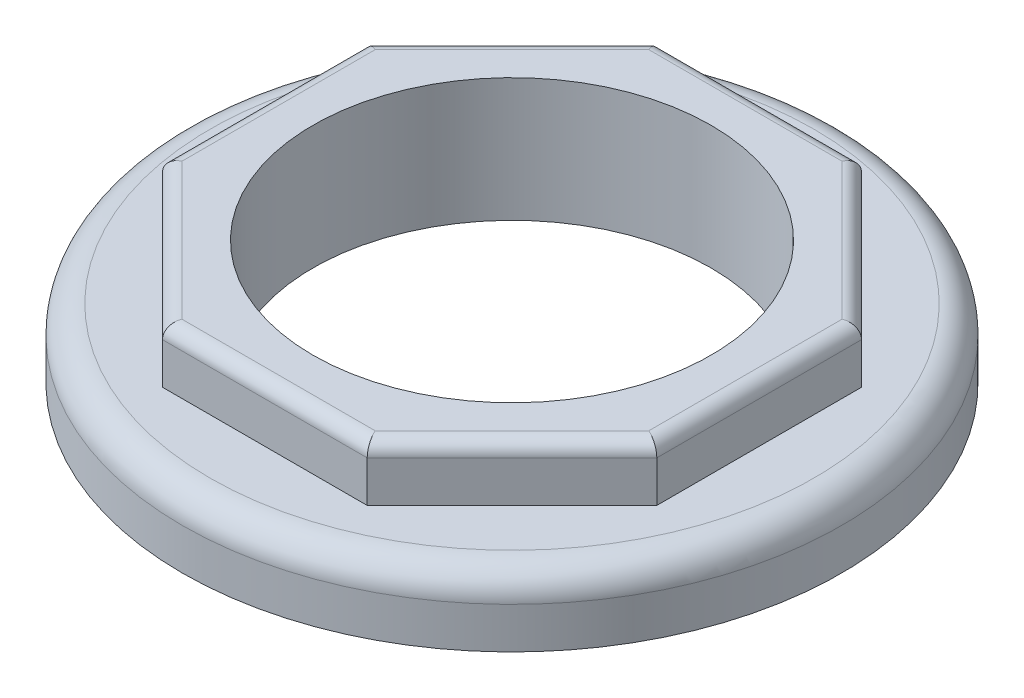
ISO-10303-21;
HEADER;
FILE_DESCRIPTION(('STEP AP214'),'2;1');
FILE_NAME('part.step','',(''),(''),'','','');
FILE_SCHEMA(('AUTOMOTIVE_DESIGN { 1 0 10303 214 1 1 1 1 }'));
ENDSEC;
DATA;
#1=APPLICATION_CONTEXT('core data for automotive mechanical design processes');
#2=APPLICATION_PROTOCOL_DEFINITION('international standard','automotive_design',2000,#1);
#3=PRODUCT_CONTEXT('',#1,'mechanical');
#4=PRODUCT('Part','Part','',(#3));
#5=PRODUCT_RELATED_PRODUCT_CATEGORY('part','',(#4));
#6=PRODUCT_DEFINITION_FORMATION('','',#4);
#7=PRODUCT_DEFINITION_CONTEXT('part definition',#1,'design');
#8=PRODUCT_DEFINITION('design','',#6,#7);
#9=PRODUCT_DEFINITION_SHAPE('','',#8);
#10=(LENGTH_UNIT() NAMED_UNIT(*) SI_UNIT(.MILLI.,.METRE.));
#11=(NAMED_UNIT(*) PLANE_ANGLE_UNIT() SI_UNIT($,.RADIAN.));
#12=(NAMED_UNIT(*) SI_UNIT($,.STERADIAN.) SOLID_ANGLE_UNIT());
#13=UNCERTAINTY_MEASURE_WITH_UNIT(LENGTH_MEASURE(1.E-05),#10,'distance_accuracy_value','');
#14=(GEOMETRIC_REPRESENTATION_CONTEXT(3) GLOBAL_UNCERTAINTY_ASSIGNED_CONTEXT((#13)) GLOBAL_UNIT_ASSIGNED_CONTEXT((#10,
#11,#12)) REPRESENTATION_CONTEXT('',''));
#15=CARTESIAN_POINT('',(0.,0.,0.));
#16=DIRECTION('',(0.,0.,1.));
#17=DIRECTION('',(1.,0.,0.));
#18=AXIS2_PLACEMENT_3D('',#15,#16,#17);
#19=CARTESIAN_POINT('',(0.,0.,0.));
#20=DIRECTION('',(0.,1.,0.));
#21=DIRECTION('',(0.,0.,1.));
#22=AXIS2_PLACEMENT_3D('',#19,#20,#21);
#23=PLANE('',#22);
#24=CARTESIAN_POINT('',(0.,0.,0.));
#25=DIRECTION('',(0.,1.,0.));
#26=DIRECTION('',(0.,0.,1.));
#27=AXIS2_PLACEMENT_3D('',#24,#25,#26);
#28=CIRCLE('',#27,14.5);
#29=CARTESIAN_POINT('',(0.,0.,14.5));
#30=VERTEX_POINT('',#29);
#31=EDGE_CURVE('E251',#30,#30,#28,.T.);
#32=ORIENTED_EDGE('',*,*,#31,.T.);
#33=EDGE_LOOP('',(#32));
#34=FACE_BOUND('',#33,.T.);
#35=CARTESIAN_POINT('',(0.,0.,0.));
#36=DIRECTION('',(0.,1.,0.));
#37=DIRECTION('',(0.,0.,1.));
#38=AXIS2_PLACEMENT_3D('',#35,#36,#37);
#39=CIRCLE('',#38,15.5);
#40=CARTESIAN_POINT('',(0.,0.,15.5));
#41=VERTEX_POINT('',#40);
#42=EDGE_CURVE('E246',#41,#41,#39,.T.);
#43=ORIENTED_EDGE('',*,*,#42,.F.);
#44=EDGE_LOOP('',(#43));
#45=FACE_BOUND('',#44,.T.);
#46=ADVANCED_FACE('F37',(#34,#45),#23,.F.);
#47=CARTESIAN_POINT('',(0.,3.,0.));
#48=DIRECTION('',(0.,1.,0.));
#49=DIRECTION('',(0.,0.,1.));
#50=AXIS2_PLACEMENT_3D('',#47,#48,#49);
#51=TOROIDAL_SURFACE('',#50,22.,2.);
#52=CARTESIAN_POINT('',(0.,5.,0.));
#53=DIRECTION('',(0.,1.,0.));
#54=DIRECTION('',(0.,0.,1.));
#55=AXIS2_PLACEMENT_3D('',#52,#53,#54);
#56=CIRCLE('',#55,22.);
#57=CARTESIAN_POINT('',(0.,5.,22.));
#58=VERTEX_POINT('',#57);
#59=EDGE_CURVE('E45',#58,#58,#56,.T.);
#60=ORIENTED_EDGE('',*,*,#59,.F.);
#61=EDGE_LOOP('',(#60));
#62=FACE_BOUND('',#61,.T.);
#63=CARTESIAN_POINT('',(0.,3.,0.));
#64=DIRECTION('',(0.,1.,0.));
#65=DIRECTION('',(0.,0.,1.));
#66=AXIS2_PLACEMENT_3D('',#63,#64,#65);
#67=CIRCLE('',#66,24.);
#68=CARTESIAN_POINT('',(0.,3.,24.));
#69=VERTEX_POINT('',#68);
#70=EDGE_CURVE('E11',#69,#69,#67,.F.);
#71=ORIENTED_EDGE('',*,*,#70,.F.);
#72=EDGE_LOOP('',(#71));
#73=FACE_BOUND('',#72,.T.);
#74=ADVANCED_FACE('F39',(#62,#73),#51,.T.);
#75=CARTESIAN_POINT('',(18.,9.,7.45584412271572));
#76=DIRECTION('',(-1.,0.,0.));
#77=DIRECTION('',(0.,0.,1.));
#78=AXIS2_PLACEMENT_3D('',#75,#76,#77);
#79=PLANE('',#78);
#80=DIRECTION('',(0.,-1.,0.));
#81=VECTOR('',#80,1.);
#82=CARTESIAN_POINT('',(18.,9.,7.45584412271572));
#83=LINE('',#82,#81);
#84=CARTESIAN_POINT('',(18.,8.,7.45584412271572));
#85=VERTEX_POINT('',#84);
#86=CARTESIAN_POINT('',(18.,5.,7.45584412271572));
#87=VERTEX_POINT('',#86);
#88=EDGE_CURVE('E283',#85,#87,#83,.T.);
#89=ORIENTED_EDGE('',*,*,#88,.T.);
#90=DIRECTION('',(0.,0.,-1.));
#91=VECTOR('',#90,1.);
#92=CARTESIAN_POINT('',(18.,5.,7.45584412271572));
#93=LINE('',#92,#91);
#94=CARTESIAN_POINT('',(18.,5.,-7.45584412271571));
#95=VERTEX_POINT('',#94);
#96=EDGE_CURVE('E52',#87,#95,#93,.T.);
#97=ORIENTED_EDGE('',*,*,#96,.T.);
#98=DIRECTION('',(0.,-1.,0.));
#99=VECTOR('',#98,1.);
#100=CARTESIAN_POINT('',(18.,9.,-7.45584412271571));
#101=LINE('',#100,#99);
#102=CARTESIAN_POINT('',(18.,8.,-7.45584412271571));
#103=VERTEX_POINT('',#102);
#104=EDGE_CURVE('E304',#103,#95,#101,.T.);
#105=ORIENTED_EDGE('',*,*,#104,.F.);
#106=DIRECTION('',(0.,0.,-1.));
#107=VECTOR('',#106,1.);
#108=CARTESIAN_POINT('',(18.,8.,7.45584412271572));
#109=LINE('',#108,#107);
#110=EDGE_CURVE('E331',#103,#85,#109,.F.);
#111=ORIENTED_EDGE('',*,*,#110,.T.);
#112=EDGE_LOOP('',(#89,#97,#105,#111));
#113=FACE_BOUND('',#112,.T.);
#114=ADVANCED_FACE('F366',(#113),#79,.F.);
#115=CARTESIAN_POINT('',(18.,9.,-7.45584412271571));
#116=DIRECTION('',(-0.707106781186547,0.,0.707106781186548));
#117=DIRECTION('',(0.707106781186548,0.,0.707106781186547));
#118=AXIS2_PLACEMENT_3D('',#115,#116,#117);
#119=PLANE('',#118);
#120=ORIENTED_EDGE('',*,*,#104,.T.);
#121=DIRECTION('',(-0.707106781186548,0.,-0.707106781186547));
#122=VECTOR('',#121,1.);
#123=CARTESIAN_POINT('',(18.,5.,-7.45584412271571));
#124=LINE('',#123,#122);
#125=CARTESIAN_POINT('',(7.45584412271571,5.,-18.));
#126=VERTEX_POINT('',#125);
#127=EDGE_CURVE('E275',#95,#126,#124,.T.);
#128=ORIENTED_EDGE('',*,*,#127,.T.);
#129=DIRECTION('',(0.,-1.,0.));
#130=VECTOR('',#129,1.);
#131=CARTESIAN_POINT('',(7.45584412271571,9.,-18.));
#132=LINE('',#131,#130);
#133=CARTESIAN_POINT('',(7.45584412271571,8.,-18.));
#134=VERTEX_POINT('',#133);
#135=EDGE_CURVE('E301',#134,#126,#132,.T.);
#136=ORIENTED_EDGE('',*,*,#135,.F.);
#137=DIRECTION('',(-0.707106781186548,0.,-0.707106781186547));
#138=VECTOR('',#137,1.);
#139=CARTESIAN_POINT('',(18.,8.,-7.45584412271571));
#140=LINE('',#139,#138);
#141=EDGE_CURVE('E329',#134,#103,#140,.F.);
#142=ORIENTED_EDGE('',*,*,#141,.T.);
#143=EDGE_LOOP('',(#120,#128,#136,#142));
#144=FACE_BOUND('',#143,.T.);
#145=ADVANCED_FACE('F474',(#144),#119,.F.);
#146=CARTESIAN_POINT('',(7.45584412271571,9.,-18.));
#147=DIRECTION('',(0.,0.,1.));
#148=DIRECTION('',(1.,0.,0.));
#149=AXIS2_PLACEMENT_3D('',#146,#147,#148);
#150=PLANE('',#149);
#151=ORIENTED_EDGE('',*,*,#135,.T.);
#152=DIRECTION('',(-1.,0.,0.));
#153=VECTOR('',#152,1.);
#154=CARTESIAN_POINT('',(7.45584412271571,5.,-18.));
#155=LINE('',#154,#153);
#156=CARTESIAN_POINT('',(-7.45584412271571,5.,-18.));
#157=VERTEX_POINT('',#156);
#158=EDGE_CURVE('E272',#126,#157,#155,.T.);
#159=ORIENTED_EDGE('',*,*,#158,.T.);
#160=DIRECTION('',(0.,-1.,0.));
#161=VECTOR('',#160,1.);
#162=CARTESIAN_POINT('',(-7.45584412271571,9.,-18.));
#163=LINE('',#162,#161);
#164=CARTESIAN_POINT('',(-7.45584412271571,8.,-18.));
#165=VERTEX_POINT('',#164);
#166=EDGE_CURVE('E298',#165,#157,#163,.T.);
#167=ORIENTED_EDGE('',*,*,#166,.F.);
#168=DIRECTION('',(-1.,0.,0.));
#169=VECTOR('',#168,1.);
#170=CARTESIAN_POINT('',(7.45584412271571,8.,-18.));
#171=LINE('',#170,#169);
#172=EDGE_CURVE('E327',#165,#134,#171,.F.);
#173=ORIENTED_EDGE('',*,*,#172,.T.);
#174=EDGE_LOOP('',(#151,#159,#167,#173));
#175=FACE_BOUND('',#174,.T.);
#176=ADVANCED_FACE('F487',(#175),#150,.F.);
#177=CARTESIAN_POINT('',(-7.45584412271571,9.,-18.));
#178=DIRECTION('',(0.707106781186548,0.,0.707106781186547));
#179=DIRECTION('',(0.707106781186547,0.,-0.707106781186548));
#180=AXIS2_PLACEMENT_3D('',#177,#178,#179);
#181=PLANE('',#180);
#182=ORIENTED_EDGE('',*,*,#166,.T.);
#183=DIRECTION('',(-0.707106781186547,0.,0.707106781186548));
#184=VECTOR('',#183,1.);
#185=CARTESIAN_POINT('',(-7.45584412271571,5.,-18.));
#186=LINE('',#185,#184);
#187=CARTESIAN_POINT('',(-18.,5.,-7.4558441227157));
#188=VERTEX_POINT('',#187);
#189=EDGE_CURVE('E269',#157,#188,#186,.T.);
#190=ORIENTED_EDGE('',*,*,#189,.T.);
#191=DIRECTION('',(0.,-1.,0.));
#192=VECTOR('',#191,1.);
#193=CARTESIAN_POINT('',(-18.,9.,-7.4558441227157));
#194=LINE('',#193,#192);
#195=CARTESIAN_POINT('',(-18.,8.,-7.4558441227157));
#196=VERTEX_POINT('',#195);
#197=EDGE_CURVE('E295',#196,#188,#194,.T.);
#198=ORIENTED_EDGE('',*,*,#197,.F.);
#199=DIRECTION('',(-0.707106781186547,0.,0.707106781186548));
#200=VECTOR('',#199,1.);
#201=CARTESIAN_POINT('',(-7.45584412271571,8.,-18.));
#202=LINE('',#201,#200);
#203=EDGE_CURVE('E324',#196,#165,#202,.F.);
#204=ORIENTED_EDGE('',*,*,#203,.T.);
#205=EDGE_LOOP('',(#182,#190,#198,#204));
#206=FACE_BOUND('',#205,.T.);
#207=ADVANCED_FACE('F484',(#206),#181,.F.);
#208=CARTESIAN_POINT('',(-18.,9.,-7.4558441227157));
#209=DIRECTION('',(1.,0.,0.));
#210=DIRECTION('',(0.,0.,-1.));
#211=AXIS2_PLACEMENT_3D('',#208,#209,#210);
#212=PLANE('',#211);
#213=ORIENTED_EDGE('',*,*,#197,.T.);
#214=DIRECTION('',(0.,0.,1.));
#215=VECTOR('',#214,1.);
#216=CARTESIAN_POINT('',(-18.,5.,-7.4558441227157));
#217=LINE('',#216,#215);
#218=CARTESIAN_POINT('',(-18.,5.,7.45584412271571));
#219=VERTEX_POINT('',#218);
#220=EDGE_CURVE('E266',#188,#219,#217,.T.);
#221=ORIENTED_EDGE('',*,*,#220,.T.);
#222=DIRECTION('',(0.,-1.,0.));
#223=VECTOR('',#222,1.);
#224=CARTESIAN_POINT('',(-18.,9.,7.45584412271571));
#225=LINE('',#224,#223);
#226=CARTESIAN_POINT('',(-18.,8.,7.45584412271571));
#227=VERTEX_POINT('',#226);
#228=EDGE_CURVE('E293',#227,#219,#225,.T.);
#229=ORIENTED_EDGE('',*,*,#228,.F.);
#230=DIRECTION('',(0.,0.,1.));
#231=VECTOR('',#230,1.);
#232=CARTESIAN_POINT('',(-18.,8.,-7.4558441227157));
#233=LINE('',#232,#231);
#234=EDGE_CURVE('E338',#227,#196,#233,.F.);
#235=ORIENTED_EDGE('',*,*,#234,.T.);
#236=EDGE_LOOP('',(#213,#221,#229,#235));
#237=FACE_BOUND('',#236,.T.);
#238=ADVANCED_FACE('F481',(#237),#212,.F.);
#239=CARTESIAN_POINT('',(-18.,9.,7.45584412271571));
#240=DIRECTION('',(0.707106781186547,0.,-0.707106781186548));
#241=DIRECTION('',(-0.707106781186548,0.,-0.707106781186547));
#242=AXIS2_PLACEMENT_3D('',#239,#240,#241);
#243=PLANE('',#242);
#244=ORIENTED_EDGE('',*,*,#228,.T.);
#245=DIRECTION('',(0.707106781186548,0.,0.707106781186547));
#246=VECTOR('',#245,1.);
#247=CARTESIAN_POINT('',(-18.,5.,7.45584412271571));
#248=LINE('',#247,#246);
#249=CARTESIAN_POINT('',(-7.45584412271569,5.,18.));
#250=VERTEX_POINT('',#249);
#251=EDGE_CURVE('E263',#219,#250,#248,.T.);
#252=ORIENTED_EDGE('',*,*,#251,.T.);
#253=DIRECTION('',(0.,-1.,0.));
#254=VECTOR('',#253,1.);
#255=CARTESIAN_POINT('',(-7.45584412271569,9.,18.));
#256=LINE('',#255,#254);
#257=CARTESIAN_POINT('',(-7.45584412271569,8.,18.));
#258=VERTEX_POINT('',#257);
#259=EDGE_CURVE('E290',#258,#250,#256,.T.);
#260=ORIENTED_EDGE('',*,*,#259,.F.);
#261=DIRECTION('',(0.707106781186548,0.,0.707106781186547));
#262=VECTOR('',#261,1.);
#263=CARTESIAN_POINT('',(-18.,8.,7.45584412271571));
#264=LINE('',#263,#262);
#265=EDGE_CURVE('E60',#258,#227,#264,.F.);
#266=ORIENTED_EDGE('',*,*,#265,.T.);
#267=EDGE_LOOP('',(#244,#252,#260,#266));
#268=FACE_BOUND('',#267,.T.);
#269=ADVANCED_FACE('F479',(#268),#243,.F.);
#270=CARTESIAN_POINT('',(-7.45584412271569,9.,18.));
#271=DIRECTION('',(0.,0.,-1.));
#272=DIRECTION('',(-1.,0.,0.));
#273=AXIS2_PLACEMENT_3D('',#270,#271,#272);
#274=PLANE('',#273);
#275=ORIENTED_EDGE('',*,*,#259,.T.);
#276=DIRECTION('',(1.,0.,0.));
#277=VECTOR('',#276,1.);
#278=CARTESIAN_POINT('',(-7.45584412271569,5.,18.));
#279=LINE('',#278,#277);
#280=CARTESIAN_POINT('',(7.45584412271571,5.,18.));
#281=VERTEX_POINT('',#280);
#282=EDGE_CURVE('E260',#250,#281,#279,.T.);
#283=ORIENTED_EDGE('',*,*,#282,.T.);
#284=DIRECTION('',(0.,-1.,0.));
#285=VECTOR('',#284,1.);
#286=CARTESIAN_POINT('',(7.45584412271571,9.,18.));
#287=LINE('',#286,#285);
#288=CARTESIAN_POINT('',(7.45584412271571,8.,18.));
#289=VERTEX_POINT('',#288);
#290=EDGE_CURVE('E287',#289,#281,#287,.T.);
#291=ORIENTED_EDGE('',*,*,#290,.F.);
#292=DIRECTION('',(1.,0.,0.));
#293=VECTOR('',#292,1.);
#294=CARTESIAN_POINT('',(-7.45584412271569,8.,18.));
#295=LINE('',#294,#293);
#296=EDGE_CURVE('E335',#289,#258,#295,.F.);
#297=ORIENTED_EDGE('',*,*,#296,.T.);
#298=EDGE_LOOP('',(#275,#283,#291,#297));
#299=FACE_BOUND('',#298,.T.);
#300=ADVANCED_FACE('F429',(#299),#274,.F.);
#301=CARTESIAN_POINT('',(7.45584412271571,9.,18.));
#302=DIRECTION('',(-0.707106781186547,0.,-0.707106781186548));
#303=DIRECTION('',(-0.707106781186548,0.,0.707106781186547));
#304=AXIS2_PLACEMENT_3D('',#301,#302,#303);
#305=PLANE('',#304);
#306=ORIENTED_EDGE('',*,*,#290,.T.);
#307=DIRECTION('',(0.707106781186548,0.,-0.707106781186547));
#308=VECTOR('',#307,1.);
#309=CARTESIAN_POINT('',(7.45584412271571,5.,18.));
#310=LINE('',#309,#308);
#311=EDGE_CURVE('E258',#281,#87,#310,.T.);
#312=ORIENTED_EDGE('',*,*,#311,.T.);
#313=ORIENTED_EDGE('',*,*,#88,.F.);
#314=DIRECTION('',(0.707106781186548,0.,-0.707106781186547));
#315=VECTOR('',#314,1.);
#316=CARTESIAN_POINT('',(7.45584412271571,8.,18.));
#317=LINE('',#316,#315);
#318=EDGE_CURVE('E333',#85,#289,#317,.F.);
#319=ORIENTED_EDGE('',*,*,#318,.T.);
#320=EDGE_LOOP('',(#306,#312,#313,#319));
#321=FACE_BOUND('',#320,.T.);
#322=ADVANCED_FACE('F424',(#321),#305,.F.);
#323=CARTESIAN_POINT('',(0.,9.,0.));
#324=DIRECTION('',(0.,1.,0.));
#325=DIRECTION('',(0.,0.,1.));
#326=AXIS2_PLACEMENT_3D('',#323,#324,#325);
#327=PLANE('',#326);
#328=DIRECTION('',(-1.,0.,0.));
#329=VECTOR('',#328,1.);
#330=CARTESIAN_POINT('',(-7.45584412271571,9.,-17.));
#331=LINE('',#330,#329);
#332=CARTESIAN_POINT('',(7.04163056034262,9.,-17.));
#333=VERTEX_POINT('',#332);
#334=CARTESIAN_POINT('',(-7.04163056034262,9.,-17.));
#335=VERTEX_POINT('',#334);
#336=EDGE_CURVE('E319',#333,#335,#331,.T.);
#337=ORIENTED_EDGE('',*,*,#336,.T.);
#338=DIRECTION('',(-0.707106781186547,0.,0.707106781186548));
#339=VECTOR('',#338,1.);
#340=CARTESIAN_POINT('',(-17.2928932188135,9.,-6.74873734152916));
#341=LINE('',#340,#339);
#342=CARTESIAN_POINT('',(-17.,9.,-7.04163056034261));
#343=VERTEX_POINT('',#342);
#344=EDGE_CURVE('E321',#335,#343,#341,.T.);
#345=ORIENTED_EDGE('',*,*,#344,.T.);
#346=DIRECTION('',(0.,0.,1.));
#347=VECTOR('',#346,1.);
#348=CARTESIAN_POINT('',(-17.,9.,7.45584412271571));
#349=LINE('',#348,#347);
#350=CARTESIAN_POINT('',(-17.,9.,7.04163056034261));
#351=VERTEX_POINT('',#350);
#352=EDGE_CURVE('E307',#343,#351,#349,.T.);
#353=ORIENTED_EDGE('',*,*,#352,.T.);
#354=DIRECTION('',(0.707106781186548,0.,0.707106781186547));
#355=VECTOR('',#354,1.);
#356=CARTESIAN_POINT('',(-6.74873734152914,9.,17.2928932188135));
#357=LINE('',#356,#355);
#358=CARTESIAN_POINT('',(-7.04163056034259,9.,17.));
#359=VERTEX_POINT('',#358);
#360=EDGE_CURVE('E309',#351,#359,#357,.T.);
#361=ORIENTED_EDGE('',*,*,#360,.T.);
#362=DIRECTION('',(1.,0.,0.));
#363=VECTOR('',#362,1.);
#364=CARTESIAN_POINT('',(7.45584412271571,9.,17.));
#365=LINE('',#364,#363);
#366=CARTESIAN_POINT('',(7.04163056034261,9.,17.));
#367=VERTEX_POINT('',#366);
#368=EDGE_CURVE('E311',#359,#367,#365,.T.);
#369=ORIENTED_EDGE('',*,*,#368,.T.);
#370=DIRECTION('',(0.707106781186548,0.,-0.707106781186547));
#371=VECTOR('',#370,1.);
#372=CARTESIAN_POINT('',(17.2928932188135,9.,6.74873734152917));
#373=LINE('',#372,#371);
#374=CARTESIAN_POINT('',(17.,9.,7.04163056034262));
#375=VERTEX_POINT('',#374);
#376=EDGE_CURVE('E313',#367,#375,#373,.T.);
#377=ORIENTED_EDGE('',*,*,#376,.T.);
#378=DIRECTION('',(0.,0.,-1.));
#379=VECTOR('',#378,1.);
#380=CARTESIAN_POINT('',(17.,9.,-7.45584412271571));
#381=LINE('',#380,#379);
#382=CARTESIAN_POINT('',(17.,9.,-7.04163056034261));
#383=VERTEX_POINT('',#382);
#384=EDGE_CURVE('E315',#375,#383,#381,.T.);
#385=ORIENTED_EDGE('',*,*,#384,.T.);
#386=DIRECTION('',(-0.707106781186548,0.,-0.707106781186547));
#387=VECTOR('',#386,1.);
#388=CARTESIAN_POINT('',(6.74873734152916,9.,-17.2928932188134));
#389=LINE('',#388,#387);
#390=EDGE_CURVE('E317',#383,#333,#389,.T.);
#391=ORIENTED_EDGE('',*,*,#390,.T.);
#392=EDGE_LOOP('',(#337,#345,#353,#361,#369,#377,#385,#391));
#393=FACE_BOUND('',#392,.T.);
#394=CARTESIAN_POINT('',(0.,9.,0.));
#395=DIRECTION('',(0.,1.,0.));
#396=DIRECTION('',(0.,0.,1.));
#397=AXIS2_PLACEMENT_3D('',#394,#395,#396);
#398=CIRCLE('',#397,14.5);
#399=CARTESIAN_POINT('',(0.,9.,14.5));
#400=VERTEX_POINT('',#399);
#401=EDGE_CURVE('E280',#400,#400,#398,.T.);
#402=ORIENTED_EDGE('',*,*,#401,.F.);
#403=EDGE_LOOP('',(#402));
#404=FACE_BOUND('',#403,.T.);
#405=ADVANCED_FACE('F421',(#393,#404),#327,.T.);
#406=CARTESIAN_POINT('',(0.,0.,0.));
#407=DIRECTION('',(0.,1.,0.));
#408=DIRECTION('',(0.,0.,1.));
#409=AXIS2_PLACEMENT_3D('',#406,#407,#408);
#410=CYLINDRICAL_SURFACE('',#409,14.5);
#411=ORIENTED_EDGE('',*,*,#401,.T.);
#412=EDGE_LOOP('',(#411));
#413=FACE_BOUND('',#412,.T.);
#414=ORIENTED_EDGE('',*,*,#31,.F.);
#415=EDGE_LOOP('',(#414));
#416=FACE_BOUND('',#415,.T.);
#417=ADVANCED_FACE('F418',(#413,#416),#410,.F.);
#418=CARTESIAN_POINT('',(12.0208152801713,8.,12.0208152801713));
#419=DIRECTION('',(-0.707106781186548,0.,0.707106781186547));
#420=DIRECTION('',(0.707106781186547,0.,0.707106781186548));
#421=AXIS2_PLACEMENT_3D('',#418,#419,#420);
#422=CYLINDRICAL_SURFACE('',#421,1.);
#423=CARTESIAN_POINT('',(7.04163056034261,8.,17.));
#424=DIRECTION('',(-0.923879532511287,0.,0.38268343236509));
#425=DIRECTION('',(-0.38268343236509,0.,-0.923879532511287));
#426=AXIS2_PLACEMENT_3D('',#423,#424,#425);
#427=ELLIPSE('',#426,1.08239220029239,1.);
#428=EDGE_CURVE('E355',#289,#367,#427,.T.);
#429=ORIENTED_EDGE('',*,*,#428,.F.);
#430=ORIENTED_EDGE('',*,*,#318,.F.);
#431=CARTESIAN_POINT('',(17.,8.,7.04163056034262));
#432=DIRECTION('',(-0.38268343236509,0.,0.923879532511287));
#433=DIRECTION('',(-0.923879532511287,0.,-0.38268343236509));
#434=AXIS2_PLACEMENT_3D('',#431,#432,#433);
#435=ELLIPSE('',#434,1.08239220029239,1.);
#436=EDGE_CURVE('E284',#375,#85,#435,.F.);
#437=ORIENTED_EDGE('',*,*,#436,.F.);
#438=ORIENTED_EDGE('',*,*,#376,.F.);
#439=EDGE_LOOP('',(#429,#430,#437,#438));
#440=FACE_BOUND('',#439,.T.);
#441=ADVANCED_FACE('F420',(#440),#422,.T.);
#442=CARTESIAN_POINT('',(17.,8.,0.));
#443=DIRECTION('',(0.,0.,1.));
#444=DIRECTION('',(1.,0.,0.));
#445=AXIS2_PLACEMENT_3D('',#442,#443,#444);
#446=CYLINDRICAL_SURFACE('',#445,1.);
#447=ORIENTED_EDGE('',*,*,#436,.T.);
#448=ORIENTED_EDGE('',*,*,#110,.F.);
#449=CARTESIAN_POINT('',(17.,8.,-7.04163056034261));
#450=DIRECTION('',(0.38268343236509,0.,0.923879532511287));
#451=DIRECTION('',(-0.923879532511287,0.,0.38268343236509));
#452=AXIS2_PLACEMENT_3D('',#449,#450,#451);
#453=ELLIPSE('',#452,1.08239220029239,1.);
#454=EDGE_CURVE('E352',#383,#103,#453,.F.);
#455=ORIENTED_EDGE('',*,*,#454,.F.);
#456=ORIENTED_EDGE('',*,*,#384,.F.);
#457=EDGE_LOOP('',(#447,#448,#455,#456));
#458=FACE_BOUND('',#457,.T.);
#459=ADVANCED_FACE('F467',(#458),#446,.T.);
#460=CARTESIAN_POINT('',(0.,8.,17.));
#461=DIRECTION('',(-1.,0.,0.));
#462=DIRECTION('',(0.,0.,1.));
#463=AXIS2_PLACEMENT_3D('',#460,#461,#462);
#464=CYLINDRICAL_SURFACE('',#463,1.);
#465=ORIENTED_EDGE('',*,*,#428,.T.);
#466=ORIENTED_EDGE('',*,*,#368,.F.);
#467=CARTESIAN_POINT('',(-7.04163056034259,8.,17.));
#468=DIRECTION('',(-0.923879532511287,0.,-0.38268343236509));
#469=DIRECTION('',(0.38268343236509,0.,-0.923879532511287));
#470=AXIS2_PLACEMENT_3D('',#467,#468,#469);
#471=ELLIPSE('',#470,1.08239220029239,1.);
#472=EDGE_CURVE('E349',#258,#359,#471,.T.);
#473=ORIENTED_EDGE('',*,*,#472,.F.);
#474=ORIENTED_EDGE('',*,*,#296,.F.);
#475=EDGE_LOOP('',(#465,#466,#473,#474));
#476=FACE_BOUND('',#475,.T.);
#477=ADVANCED_FACE('F457',(#476),#464,.T.);
#478=CARTESIAN_POINT('',(12.0208152801713,8.,-12.0208152801713));
#479=DIRECTION('',(0.707106781186548,0.,0.707106781186547));
#480=DIRECTION('',(0.707106781186547,0.,-0.707106781186548));
#481=AXIS2_PLACEMENT_3D('',#478,#479,#480);
#482=CYLINDRICAL_SURFACE('',#481,1.);
#483=ORIENTED_EDGE('',*,*,#454,.T.);
#484=ORIENTED_EDGE('',*,*,#141,.F.);
#485=CARTESIAN_POINT('',(7.04163056034262,8.,-17.));
#486=DIRECTION('',(0.923879532511287,0.,0.38268343236509));
#487=DIRECTION('',(-0.38268343236509,0.,0.923879532511287));
#488=AXIS2_PLACEMENT_3D('',#485,#486,#487);
#489=ELLIPSE('',#488,1.08239220029239,1.);
#490=EDGE_CURVE('E346',#333,#134,#489,.F.);
#491=ORIENTED_EDGE('',*,*,#490,.F.);
#492=ORIENTED_EDGE('',*,*,#390,.F.);
#493=EDGE_LOOP('',(#483,#484,#491,#492));
#494=FACE_BOUND('',#493,.T.);
#495=ADVANCED_FACE('F470',(#494),#482,.T.);
#496=CARTESIAN_POINT('',(-12.0208152801713,8.,12.0208152801713));
#497=DIRECTION('',(-0.707106781186548,0.,-0.707106781186547));
#498=DIRECTION('',(-0.707106781186547,0.,0.707106781186548));
#499=AXIS2_PLACEMENT_3D('',#496,#497,#498);
#500=CYLINDRICAL_SURFACE('',#499,1.);
#501=ORIENTED_EDGE('',*,*,#472,.T.);
#502=ORIENTED_EDGE('',*,*,#360,.F.);
#503=CARTESIAN_POINT('',(-17.,8.,7.04163056034261));
#504=DIRECTION('',(-0.38268343236509,0.,-0.923879532511287));
#505=DIRECTION('',(0.923879532511287,0.,-0.38268343236509));
#506=AXIS2_PLACEMENT_3D('',#503,#504,#505);
#507=ELLIPSE('',#506,1.08239220029239,1.);
#508=EDGE_CURVE('E343',#227,#351,#507,.T.);
#509=ORIENTED_EDGE('',*,*,#508,.F.);
#510=ORIENTED_EDGE('',*,*,#265,.F.);
#511=EDGE_LOOP('',(#501,#502,#509,#510));
#512=FACE_BOUND('',#511,.T.);
#513=ADVANCED_FACE('F453',(#512),#500,.T.);
#514=CARTESIAN_POINT('',(0.,8.,-17.));
#515=DIRECTION('',(1.,0.,0.));
#516=DIRECTION('',(0.,0.,-1.));
#517=AXIS2_PLACEMENT_3D('',#514,#515,#516);
#518=CYLINDRICAL_SURFACE('',#517,1.);
#519=ORIENTED_EDGE('',*,*,#490,.T.);
#520=ORIENTED_EDGE('',*,*,#172,.F.);
#521=CARTESIAN_POINT('',(-7.04163056034262,8.,-17.));
#522=DIRECTION('',(0.923879532511287,0.,-0.38268343236509));
#523=DIRECTION('',(0.38268343236509,0.,0.923879532511287));
#524=AXIS2_PLACEMENT_3D('',#521,#522,#523);
#525=ELLIPSE('',#524,1.08239220029239,1.);
#526=EDGE_CURVE('E341',#335,#165,#525,.F.);
#527=ORIENTED_EDGE('',*,*,#526,.F.);
#528=ORIENTED_EDGE('',*,*,#336,.F.);
#529=EDGE_LOOP('',(#519,#520,#527,#528));
#530=FACE_BOUND('',#529,.T.);
#531=ADVANCED_FACE('F441',(#530),#518,.T.);
#532=CARTESIAN_POINT('',(-17.,8.,0.));
#533=DIRECTION('',(0.,0.,-1.));
#534=DIRECTION('',(-1.,0.,0.));
#535=AXIS2_PLACEMENT_3D('',#532,#533,#534);
#536=CYLINDRICAL_SURFACE('',#535,1.);
#537=ORIENTED_EDGE('',*,*,#508,.T.);
#538=ORIENTED_EDGE('',*,*,#352,.F.);
#539=CARTESIAN_POINT('',(-17.,8.,-7.04163056034261));
#540=DIRECTION('',(0.38268343236509,0.,-0.923879532511287));
#541=DIRECTION('',(-0.923879532511287,0.,-0.38268343236509));
#542=AXIS2_PLACEMENT_3D('',#539,#540,#541);
#543=ELLIPSE('',#542,1.08239220029239,1.);
#544=EDGE_CURVE('E279',#196,#343,#543,.T.);
#545=ORIENTED_EDGE('',*,*,#544,.F.);
#546=ORIENTED_EDGE('',*,*,#234,.F.);
#547=EDGE_LOOP('',(#537,#538,#545,#546));
#548=FACE_BOUND('',#547,.T.);
#549=ADVANCED_FACE('F448',(#548),#536,.T.);
#550=CARTESIAN_POINT('',(-12.0208152801713,8.,-12.0208152801713));
#551=DIRECTION('',(0.707106781186547,0.,-0.707106781186548));
#552=DIRECTION('',(-0.707106781186548,0.,-0.707106781186547));
#553=AXIS2_PLACEMENT_3D('',#550,#551,#552);
#554=CYLINDRICAL_SURFACE('',#553,1.);
#555=ORIENTED_EDGE('',*,*,#526,.T.);
#556=ORIENTED_EDGE('',*,*,#203,.F.);
#557=ORIENTED_EDGE('',*,*,#544,.T.);
#558=ORIENTED_EDGE('',*,*,#344,.F.);
#559=EDGE_LOOP('',(#555,#556,#557,#558));
#560=FACE_BOUND('',#559,.T.);
#561=ADVANCED_FACE('F416',(#560),#554,.T.);
#562=CARTESIAN_POINT('',(0.,5.,0.));
#563=DIRECTION('',(0.,1.,0.));
#564=DIRECTION('',(0.,0.,1.));
#565=AXIS2_PLACEMENT_3D('',#562,#563,#564);
#566=PLANE('',#565);
#567=ORIENTED_EDGE('',*,*,#59,.T.);
#568=EDGE_LOOP('',(#567));
#569=FACE_BOUND('',#568,.T.);
#570=ORIENTED_EDGE('',*,*,#96,.F.);
#571=ORIENTED_EDGE('',*,*,#311,.F.);
#572=ORIENTED_EDGE('',*,*,#282,.F.);
#573=ORIENTED_EDGE('',*,*,#251,.F.);
#574=ORIENTED_EDGE('',*,*,#220,.F.);
#575=ORIENTED_EDGE('',*,*,#189,.F.);
#576=ORIENTED_EDGE('',*,*,#158,.F.);
#577=ORIENTED_EDGE('',*,*,#127,.F.);
#578=EDGE_LOOP('',(#570,#571,#572,#573,#574,#575,#576,#577));
#579=FACE_BOUND('',#578,.T.);
#580=ADVANCED_FACE('F362',(#569,#579),#566,.T.);
#581=CARTESIAN_POINT('',(0.,0.,0.));
#582=DIRECTION('',(0.,1.,0.));
#583=DIRECTION('',(0.,0.,1.));
#584=AXIS2_PLACEMENT_3D('',#581,#582,#583);
#585=CYLINDRICAL_SURFACE('',#584,24.);
#586=ORIENTED_EDGE('',*,*,#70,.T.);
#587=EDGE_LOOP('',(#586));
#588=FACE_BOUND('',#587,.T.);
#589=CARTESIAN_POINT('',(0.,0.,0.));
#590=DIRECTION('',(0.,1.,0.));
#591=DIRECTION('',(0.,0.,1.));
#592=AXIS2_PLACEMENT_3D('',#589,#590,#591);
#593=CIRCLE('',#592,24.);
#594=CARTESIAN_POINT('',(0.,0.,24.));
#595=VERTEX_POINT('',#594);
#596=EDGE_CURVE('E254',#595,#595,#593,.T.);
#597=ORIENTED_EDGE('',*,*,#596,.T.);
#598=EDGE_LOOP('',(#597));
#599=FACE_BOUND('',#598,.T.);
#600=ADVANCED_FACE('F369',(#588,#599),#585,.T.);
#601=CARTESIAN_POINT('',(0.,0.,0.));
#602=DIRECTION('',(0.,1.,0.));
#603=DIRECTION('',(0.,0.,1.));
#604=AXIS2_PLACEMENT_3D('',#601,#602,#603);
#605=CIRCLE('',#604,23.);
#606=CARTESIAN_POINT('',(0.,0.,23.));
#607=VERTEX_POINT('',#606);
#608=EDGE_CURVE('E197',#607,#607,#605,.T.);
#609=ORIENTED_EDGE('',*,*,#608,.T.);
#610=EDGE_LOOP('',(#609));
#611=FACE_BOUND('',#610,.T.);
#612=ORIENTED_EDGE('',*,*,#596,.F.);
#613=EDGE_LOOP('',(#612));
#614=FACE_BOUND('',#613,.T.);
#615=ADVANCED_FACE('F372',(#611,#614),#23,.F.);
#616=CARTESIAN_POINT('',(0.,3.,0.));
#617=DIRECTION('',(0.,1.,0.));
#618=DIRECTION('',(0.,0.,1.));
#619=AXIS2_PLACEMENT_3D('',#616,#617,#618);
#620=TOROIDAL_SURFACE('',#619,22.,1.);
#621=CARTESIAN_POINT('',(0.,4.,0.));
#622=DIRECTION('',(0.,1.,0.));
#623=DIRECTION('',(0.,0.,1.));
#624=AXIS2_PLACEMENT_3D('',#621,#622,#623);
#625=CIRCLE('',#624,22.);
#626=CARTESIAN_POINT('',(0.,4.,22.));
#627=VERTEX_POINT('',#626);
#628=EDGE_CURVE('E244',#627,#627,#625,.T.);
#629=ORIENTED_EDGE('',*,*,#628,.T.);
#630=EDGE_LOOP('',(#629));
#631=FACE_BOUND('',#630,.T.);
#632=CARTESIAN_POINT('',(0.,3.,0.));
#633=DIRECTION('',(0.,1.,0.));
#634=DIRECTION('',(0.,0.,1.));
#635=AXIS2_PLACEMENT_3D('',#632,#633,#634);
#636=CIRCLE('',#635,23.);
#637=CARTESIAN_POINT('',(0.,3.,23.));
#638=VERTEX_POINT('',#637);
#639=EDGE_CURVE('E255',#638,#638,#636,.F.);
#640=ORIENTED_EDGE('',*,*,#639,.T.);
#641=EDGE_LOOP('',(#640));
#642=FACE_BOUND('',#641,.T.);
#643=ADVANCED_FACE('F377',(#631,#642),#620,.F.);
#644=CARTESIAN_POINT('',(17.,9.,7.45584412271572));
#645=DIRECTION('',(-1.,0.,0.));
#646=DIRECTION('',(0.,0.,1.));
#647=AXIS2_PLACEMENT_3D('',#644,#645,#646);
#648=PLANE('',#647);
#649=DIRECTION('',(0.,-1.,0.));
#650=VECTOR('',#649,1.);
#651=CARTESIAN_POINT('',(17.,9.,7.04163056034262));
#652=LINE('',#651,#650);
#653=CARTESIAN_POINT('',(17.,8.,7.04163056034262));
#654=VERTEX_POINT('',#653);
#655=CARTESIAN_POINT('',(17.,4.,7.04163056034262));
#656=VERTEX_POINT('',#655);
#657=EDGE_CURVE('E181',#654,#656,#652,.T.);
#658=ORIENTED_EDGE('',*,*,#657,.F.);
#659=DIRECTION('',(0.,0.,1.));
#660=VECTOR('',#659,1.);
#661=CARTESIAN_POINT('',(17.,8.,0.));
#662=LINE('',#661,#660);
#663=CARTESIAN_POINT('',(17.,8.,-7.04163056034261));
#664=VERTEX_POINT('',#663);
#665=EDGE_CURVE('E215',#664,#654,#662,.T.);
#666=ORIENTED_EDGE('',*,*,#665,.F.);
#667=DIRECTION('',(0.,-1.,0.));
#668=VECTOR('',#667,1.);
#669=CARTESIAN_POINT('',(17.,9.,-7.04163056034261));
#670=LINE('',#669,#668);
#671=CARTESIAN_POINT('',(17.,4.,-7.04163056034261));
#672=VERTEX_POINT('',#671);
#673=EDGE_CURVE('E183',#664,#672,#670,.T.);
#674=ORIENTED_EDGE('',*,*,#673,.T.);
#675=DIRECTION('',(0.,0.,-1.));
#676=VECTOR('',#675,1.);
#677=CARTESIAN_POINT('',(17.,4.,7.45584412271572));
#678=LINE('',#677,#676);
#679=EDGE_CURVE('E176',#656,#672,#678,.T.);
#680=ORIENTED_EDGE('',*,*,#679,.F.);
#681=EDGE_LOOP('',(#658,#666,#674,#680));
#682=FACE_BOUND('',#681,.T.);
#683=ADVANCED_FACE('F178',(#682),#648,.T.);
#684=CARTESIAN_POINT('',(17.2928932188135,9.,-6.74873734152916));
#685=DIRECTION('',(-0.707106781186547,0.,0.707106781186548));
#686=DIRECTION('',(0.707106781186548,0.,0.707106781186547));
#687=AXIS2_PLACEMENT_3D('',#684,#685,#686);
#688=PLANE('',#687);
#689=ORIENTED_EDGE('',*,*,#673,.F.);
#690=DIRECTION('',(0.707106781186548,0.,0.707106781186547));
#691=VECTOR('',#690,1.);
#692=CARTESIAN_POINT('',(12.0208152801713,8.,-12.0208152801713));
#693=LINE('',#692,#691);
#694=CARTESIAN_POINT('',(7.04163056034262,8.,-17.));
#695=VERTEX_POINT('',#694);
#696=EDGE_CURVE('E217',#695,#664,#693,.T.);
#697=ORIENTED_EDGE('',*,*,#696,.F.);
#698=DIRECTION('',(0.,-1.,0.));
#699=VECTOR('',#698,1.);
#700=CARTESIAN_POINT('',(7.04163056034262,9.,-17.));
#701=LINE('',#700,#699);
#702=CARTESIAN_POINT('',(7.04163056034261,4.,-17.));
#703=VERTEX_POINT('',#702);
#704=EDGE_CURVE('E214',#695,#703,#701,.T.);
#705=ORIENTED_EDGE('',*,*,#704,.T.);
#706=DIRECTION('',(-0.707106781186548,0.,-0.707106781186547));
#707=VECTOR('',#706,1.);
#708=CARTESIAN_POINT('',(17.2928932188135,4.,-6.74873734152916));
#709=LINE('',#708,#707);
#710=EDGE_CURVE('E187',#672,#703,#709,.T.);
#711=ORIENTED_EDGE('',*,*,#710,.F.);
#712=EDGE_LOOP('',(#689,#697,#705,#711));
#713=FACE_BOUND('',#712,.T.);
#714=ADVANCED_FACE('F582',(#713),#688,.T.);
#715=CARTESIAN_POINT('',(7.45584412271571,9.,-17.));
#716=DIRECTION('',(0.,0.,1.));
#717=DIRECTION('',(1.,0.,0.));
#718=AXIS2_PLACEMENT_3D('',#715,#716,#717);
#719=PLANE('',#718);
#720=ORIENTED_EDGE('',*,*,#704,.F.);
#721=DIRECTION('',(1.,0.,0.));
#722=VECTOR('',#721,1.);
#723=CARTESIAN_POINT('',(0.,8.,-17.));
#724=LINE('',#723,#722);
#725=CARTESIAN_POINT('',(-7.04163056034261,8.,-17.));
#726=VERTEX_POINT('',#725);
#727=EDGE_CURVE('E223',#726,#695,#724,.T.);
#728=ORIENTED_EDGE('',*,*,#727,.F.);
#729=DIRECTION('',(0.,-1.,0.));
#730=VECTOR('',#729,1.);
#731=CARTESIAN_POINT('',(-7.04163056034261,9.,-17.));
#732=LINE('',#731,#730);
#733=CARTESIAN_POINT('',(-7.04163056034261,4.,-17.));
#734=VERTEX_POINT('',#733);
#735=EDGE_CURVE('E220',#726,#734,#732,.T.);
#736=ORIENTED_EDGE('',*,*,#735,.T.);
#737=DIRECTION('',(-1.,0.,0.));
#738=VECTOR('',#737,1.);
#739=CARTESIAN_POINT('',(7.45584412271571,4.,-17.));
#740=LINE('',#739,#738);
#741=EDGE_CURVE('E688',#703,#734,#740,.T.);
#742=ORIENTED_EDGE('',*,*,#741,.F.);
#743=EDGE_LOOP('',(#720,#728,#736,#742));
#744=FACE_BOUND('',#743,.T.);
#745=ADVANCED_FACE('F591',(#744),#719,.T.);
#746=CARTESIAN_POINT('',(-6.74873734152916,9.,-17.2928932188134));
#747=DIRECTION('',(0.707106781186548,0.,0.707106781186547));
#748=DIRECTION('',(0.707106781186547,0.,-0.707106781186548));
#749=AXIS2_PLACEMENT_3D('',#746,#747,#748);
#750=PLANE('',#749);
#751=ORIENTED_EDGE('',*,*,#735,.F.);
#752=DIRECTION('',(0.707106781186547,0.,-0.707106781186548));
#753=VECTOR('',#752,1.);
#754=CARTESIAN_POINT('',(-12.0208152801713,8.,-12.0208152801713));
#755=LINE('',#754,#753);
#756=CARTESIAN_POINT('',(-17.,8.,-7.04163056034261));
#757=VERTEX_POINT('',#756);
#758=EDGE_CURVE('E229',#757,#726,#755,.T.);
#759=ORIENTED_EDGE('',*,*,#758,.F.);
#760=DIRECTION('',(0.,-1.,0.));
#761=VECTOR('',#760,1.);
#762=CARTESIAN_POINT('',(-17.,9.,-7.04163056034261));
#763=LINE('',#762,#761);
#764=CARTESIAN_POINT('',(-17.,4.,-7.04163056034261));
#765=VERTEX_POINT('',#764);
#766=EDGE_CURVE('E226',#757,#765,#763,.T.);
#767=ORIENTED_EDGE('',*,*,#766,.T.);
#768=DIRECTION('',(-0.707106781186547,0.,0.707106781186548));
#769=VECTOR('',#768,1.);
#770=CARTESIAN_POINT('',(-6.74873734152916,4.,-17.2928932188134));
#771=LINE('',#770,#769);
#772=EDGE_CURVE('E689',#734,#765,#771,.T.);
#773=ORIENTED_EDGE('',*,*,#772,.F.);
#774=EDGE_LOOP('',(#751,#759,#767,#773));
#775=FACE_BOUND('',#774,.T.);
#776=ADVANCED_FACE('F601',(#775),#750,.T.);
#777=CARTESIAN_POINT('',(-17.,9.,-7.4558441227157));
#778=DIRECTION('',(1.,0.,0.));
#779=DIRECTION('',(0.,0.,-1.));
#780=AXIS2_PLACEMENT_3D('',#777,#778,#779);
#781=PLANE('',#780);
#782=ORIENTED_EDGE('',*,*,#766,.F.);
#783=DIRECTION('',(0.,0.,1.));
#784=VECTOR('',#783,1.);
#785=CARTESIAN_POINT('',(-17.,8.,-7.4558441227157));
#786=LINE('',#785,#784);
#787=CARTESIAN_POINT('',(-17.,8.,7.04163056034261));
#788=VERTEX_POINT('',#787);
#789=EDGE_CURVE('E213',#757,#788,#786,.T.);
#790=ORIENTED_EDGE('',*,*,#789,.T.);
#791=DIRECTION('',(0.,-1.,0.));
#792=VECTOR('',#791,1.);
#793=CARTESIAN_POINT('',(-17.,9.,7.04163056034261));
#794=LINE('',#793,#792);
#795=CARTESIAN_POINT('',(-17.,4.,7.04163056034261));
#796=VERTEX_POINT('',#795);
#797=EDGE_CURVE('E232',#788,#796,#794,.T.);
#798=ORIENTED_EDGE('',*,*,#797,.T.);
#799=DIRECTION('',(0.,0.,1.));
#800=VECTOR('',#799,1.);
#801=CARTESIAN_POINT('',(-17.,4.,-7.4558441227157));
#802=LINE('',#801,#800);
#803=EDGE_CURVE('E691',#765,#796,#802,.T.);
#804=ORIENTED_EDGE('',*,*,#803,.F.);
#805=EDGE_LOOP('',(#782,#790,#798,#804));
#806=FACE_BOUND('',#805,.T.);
#807=ADVANCED_FACE('F611',(#806),#781,.T.);
#808=CARTESIAN_POINT('',(-17.2928932188134,9.,6.74873734152916));
#809=DIRECTION('',(0.707106781186547,0.,-0.707106781186548));
#810=DIRECTION('',(-0.707106781186548,0.,-0.707106781186547));
#811=AXIS2_PLACEMENT_3D('',#808,#809,#810);
#812=PLANE('',#811);
#813=ORIENTED_EDGE('',*,*,#797,.F.);
#814=DIRECTION('',(0.707106781186548,0.,0.707106781186547));
#815=VECTOR('',#814,1.);
#816=CARTESIAN_POINT('',(-17.2928932188134,8.,6.74873734152916));
#817=LINE('',#816,#815);
#818=CARTESIAN_POINT('',(-7.04163056034259,8.,17.));
#819=VERTEX_POINT('',#818);
#820=EDGE_CURVE('E239',#788,#819,#817,.T.);
#821=ORIENTED_EDGE('',*,*,#820,.T.);
#822=DIRECTION('',(0.,-1.,0.));
#823=VECTOR('',#822,1.);
#824=CARTESIAN_POINT('',(-7.04163056034259,9.,17.));
#825=LINE('',#824,#823);
#826=CARTESIAN_POINT('',(-7.0416305603426,4.,17.));
#827=VERTEX_POINT('',#826);
#828=EDGE_CURVE('E205',#819,#827,#825,.T.);
#829=ORIENTED_EDGE('',*,*,#828,.T.);
#830=DIRECTION('',(0.707106781186548,0.,0.707106781186547));
#831=VECTOR('',#830,1.);
#832=CARTESIAN_POINT('',(-17.2928932188134,4.,6.74873734152916));
#833=LINE('',#832,#831);
#834=EDGE_CURVE('E680',#796,#827,#833,.T.);
#835=ORIENTED_EDGE('',*,*,#834,.F.);
#836=EDGE_LOOP('',(#813,#821,#829,#835));
#837=FACE_BOUND('',#836,.T.);
#838=ADVANCED_FACE('F621',(#837),#812,.T.);
#839=CARTESIAN_POINT('',(-7.45584412271569,9.,17.));
#840=DIRECTION('',(0.,0.,-1.));
#841=DIRECTION('',(-1.,0.,0.));
#842=AXIS2_PLACEMENT_3D('',#839,#840,#841);
#843=PLANE('',#842);
#844=ORIENTED_EDGE('',*,*,#828,.F.);
#845=DIRECTION('',(1.,0.,0.));
#846=VECTOR('',#845,1.);
#847=CARTESIAN_POINT('',(-7.45584412271569,8.,17.));
#848=LINE('',#847,#846);
#849=CARTESIAN_POINT('',(7.04163056034262,8.,17.));
#850=VERTEX_POINT('',#849);
#851=EDGE_CURVE('E235',#819,#850,#848,.T.);
#852=ORIENTED_EDGE('',*,*,#851,.T.);
#853=DIRECTION('',(0.,-1.,0.));
#854=VECTOR('',#853,1.);
#855=CARTESIAN_POINT('',(7.04163056034262,9.,17.));
#856=LINE('',#855,#854);
#857=CARTESIAN_POINT('',(7.04163056034262,4.,17.));
#858=VERTEX_POINT('',#857);
#859=EDGE_CURVE('E203',#850,#858,#856,.T.);
#860=ORIENTED_EDGE('',*,*,#859,.T.);
#861=DIRECTION('',(1.,0.,0.));
#862=VECTOR('',#861,1.);
#863=CARTESIAN_POINT('',(-7.45584412271569,4.,17.));
#864=LINE('',#863,#862);
#865=EDGE_CURVE('E193',#827,#858,#864,.T.);
#866=ORIENTED_EDGE('',*,*,#865,.F.);
#867=EDGE_LOOP('',(#844,#852,#860,#866));
#868=FACE_BOUND('',#867,.T.);
#869=ADVANCED_FACE('F631',(#868),#843,.T.);
#870=CARTESIAN_POINT('',(6.74873734152916,9.,17.2928932188135));
#871=DIRECTION('',(-0.707106781186547,0.,-0.707106781186548));
#872=DIRECTION('',(-0.707106781186548,0.,0.707106781186547));
#873=AXIS2_PLACEMENT_3D('',#870,#871,#872);
#874=PLANE('',#873);
#875=ORIENTED_EDGE('',*,*,#859,.F.);
#876=DIRECTION('',(-0.707106781186548,0.,0.707106781186547));
#877=VECTOR('',#876,1.);
#878=CARTESIAN_POINT('',(12.0208152801713,8.,12.0208152801713));
#879=LINE('',#878,#877);
#880=EDGE_CURVE('E202',#654,#850,#879,.T.);
#881=ORIENTED_EDGE('',*,*,#880,.F.);
#882=ORIENTED_EDGE('',*,*,#657,.T.);
#883=DIRECTION('',(0.707106781186548,0.,-0.707106781186547));
#884=VECTOR('',#883,1.);
#885=CARTESIAN_POINT('',(6.74873734152916,4.,17.2928932188135));
#886=LINE('',#885,#884);
#887=EDGE_CURVE('E190',#858,#656,#886,.T.);
#888=ORIENTED_EDGE('',*,*,#887,.F.);
#889=EDGE_LOOP('',(#875,#881,#882,#888));
#890=FACE_BOUND('',#889,.T.);
#891=ADVANCED_FACE('F200',(#890),#874,.T.);
#892=CARTESIAN_POINT('',(0.,8.,0.));
#893=DIRECTION('',(0.,1.,0.));
#894=DIRECTION('',(0.,0.,1.));
#895=AXIS2_PLACEMENT_3D('',#892,#893,#894);
#896=PLANE('',#895);
#897=ORIENTED_EDGE('',*,*,#727,.T.);
#898=ORIENTED_EDGE('',*,*,#696,.T.);
#899=ORIENTED_EDGE('',*,*,#665,.T.);
#900=ORIENTED_EDGE('',*,*,#880,.T.);
#901=ORIENTED_EDGE('',*,*,#851,.F.);
#902=ORIENTED_EDGE('',*,*,#820,.F.);
#903=ORIENTED_EDGE('',*,*,#789,.F.);
#904=ORIENTED_EDGE('',*,*,#758,.T.);
#905=EDGE_LOOP('',(#897,#898,#899,#900,#901,#902,#903,#904));
#906=FACE_BOUND('',#905,.T.);
#907=CARTESIAN_POINT('',(0.,8.,0.));
#908=DIRECTION('',(0.,1.,0.));
#909=DIRECTION('',(0.,0.,1.));
#910=AXIS2_PLACEMENT_3D('',#907,#908,#909);
#911=CIRCLE('',#910,15.5);
#912=CARTESIAN_POINT('',(0.,8.,15.5));
#913=VERTEX_POINT('',#912);
#914=EDGE_CURVE('E186',#913,#913,#911,.T.);
#915=ORIENTED_EDGE('',*,*,#914,.T.);
#916=EDGE_LOOP('',(#915));
#917=FACE_BOUND('',#916,.T.);
#918=ADVANCED_FACE('F397',(#906,#917),#896,.F.);
#919=CARTESIAN_POINT('',(0.,0.,0.));
#920=DIRECTION('',(0.,1.,0.));
#921=DIRECTION('',(0.,0.,1.));
#922=AXIS2_PLACEMENT_3D('',#919,#920,#921);
#923=CYLINDRICAL_SURFACE('',#922,15.5);
#924=ORIENTED_EDGE('',*,*,#914,.F.);
#925=EDGE_LOOP('',(#924));
#926=FACE_BOUND('',#925,.T.);
#927=ORIENTED_EDGE('',*,*,#42,.T.);
#928=EDGE_LOOP('',(#927));
#929=FACE_BOUND('',#928,.T.);
#930=ADVANCED_FACE('F395',(#926,#929),#923,.T.);
#931=CARTESIAN_POINT('',(0.,4.,0.));
#932=DIRECTION('',(0.,1.,0.));
#933=DIRECTION('',(0.,0.,1.));
#934=AXIS2_PLACEMENT_3D('',#931,#932,#933);
#935=PLANE('',#934);
#936=ORIENTED_EDGE('',*,*,#628,.F.);
#937=EDGE_LOOP('',(#936));
#938=FACE_BOUND('',#937,.T.);
#939=ORIENTED_EDGE('',*,*,#679,.T.);
#940=ORIENTED_EDGE('',*,*,#710,.T.);
#941=ORIENTED_EDGE('',*,*,#741,.T.);
#942=ORIENTED_EDGE('',*,*,#772,.T.);
#943=ORIENTED_EDGE('',*,*,#803,.T.);
#944=ORIENTED_EDGE('',*,*,#834,.T.);
#945=ORIENTED_EDGE('',*,*,#865,.T.);
#946=ORIENTED_EDGE('',*,*,#887,.T.);
#947=EDGE_LOOP('',(#939,#940,#941,#942,#943,#944,#945,#946));
#948=FACE_BOUND('',#947,.T.);
#949=ADVANCED_FACE('F191',(#938,#948),#935,.F.);
#950=CARTESIAN_POINT('',(0.,0.,0.));
#951=DIRECTION('',(0.,1.,0.));
#952=DIRECTION('',(0.,0.,1.));
#953=AXIS2_PLACEMENT_3D('',#950,#951,#952);
#954=CYLINDRICAL_SURFACE('',#953,23.);
#955=ORIENTED_EDGE('',*,*,#639,.F.);
#956=EDGE_LOOP('',(#955));
#957=FACE_BOUND('',#956,.T.);
#958=ORIENTED_EDGE('',*,*,#608,.F.);
#959=EDGE_LOOP('',(#958));
#960=FACE_BOUND('',#959,.T.);
#961=ADVANCED_FACE('F404',(#957,#960),#954,.F.);
#962=CLOSED_SHELL('',(#46,#74,#114,#145,#176,#207,#238,#269,#300,#322,#405,#417,#441,#459,#477,
#495,#513,#531,#549,#561,#580,#600,#615,#643,#683,#714,#745,#776,#807,#838,#869,#891,#918,#930,
#949,#961));
#963=MANIFOLD_SOLID_BREP('B2',#962);
#964=ADVANCED_BREP_SHAPE_REPRESENTATION('',(#18,#963),#14);
#965=SHAPE_DEFINITION_REPRESENTATION(#9,#964);
ENDSEC;
END-ISO-10303-21;
